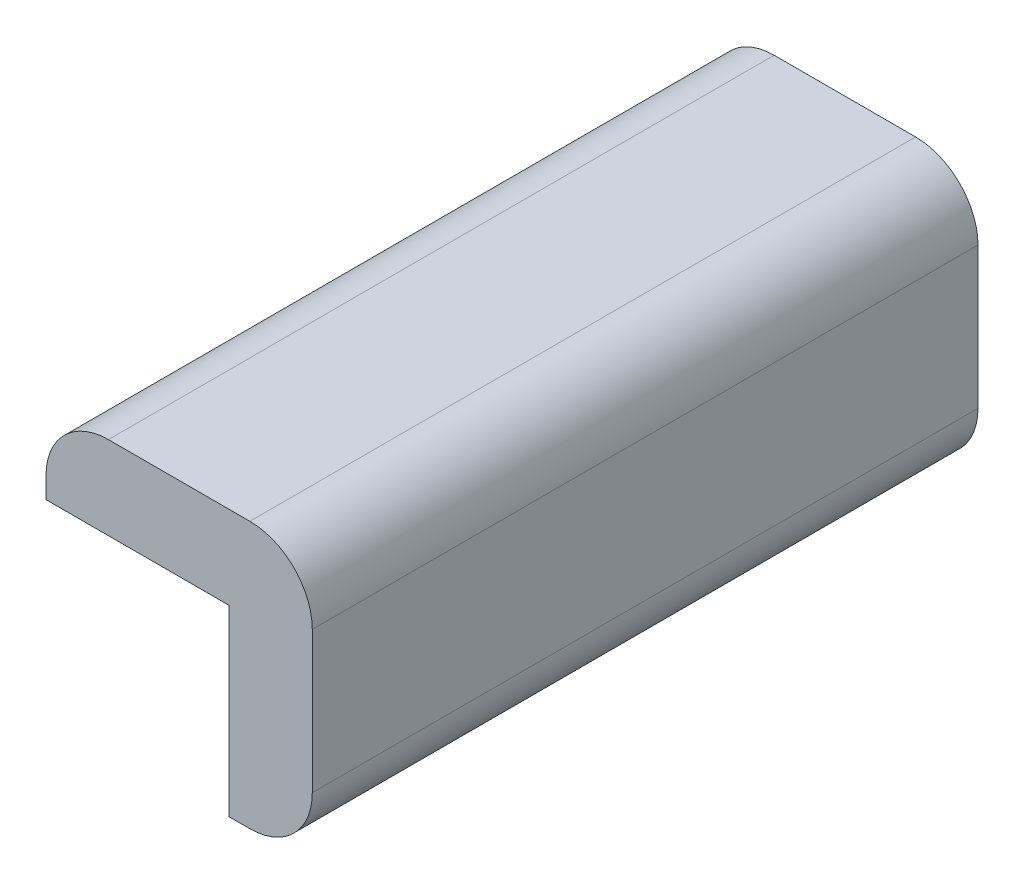
ISO-10303-21;
HEADER;
FILE_DESCRIPTION(('STEP AP214'),'2;1');
FILE_NAME('part.step','',(''),(''),'','','');
FILE_SCHEMA(('AUTOMOTIVE_DESIGN { 1 0 10303 214 1 1 1 1 }'));
ENDSEC;
DATA;
#1=APPLICATION_CONTEXT('core data for automotive mechanical design processes');
#2=APPLICATION_PROTOCOL_DEFINITION('international standard','automotive_design',2000,#1);
#3=PRODUCT_CONTEXT('',#1,'mechanical');
#4=PRODUCT('Part','Part','',(#3));
#5=PRODUCT_RELATED_PRODUCT_CATEGORY('part','',(#4));
#6=PRODUCT_DEFINITION_FORMATION('','',#4);
#7=PRODUCT_DEFINITION_CONTEXT('part definition',#1,'design');
#8=PRODUCT_DEFINITION('design','',#6,#7);
#9=PRODUCT_DEFINITION_SHAPE('','',#8);
#10=(LENGTH_UNIT() NAMED_UNIT(*) SI_UNIT(.MILLI.,.METRE.));
#11=(NAMED_UNIT(*) PLANE_ANGLE_UNIT() SI_UNIT($,.RADIAN.));
#12=(NAMED_UNIT(*) SI_UNIT($,.STERADIAN.) SOLID_ANGLE_UNIT());
#13=UNCERTAINTY_MEASURE_WITH_UNIT(LENGTH_MEASURE(1.E-05),#10,'distance_accuracy_value','');
#14=(GEOMETRIC_REPRESENTATION_CONTEXT(3) GLOBAL_UNCERTAINTY_ASSIGNED_CONTEXT((#13)) GLOBAL_UNIT_ASSIGNED_CONTEXT((#10,
#11,#12)) REPRESENTATION_CONTEXT('',''));
#15=CARTESIAN_POINT('',(0.,0.,0.));
#16=DIRECTION('',(0.,0.,1.));
#17=DIRECTION('',(1.,0.,0.));
#18=AXIS2_PLACEMENT_3D('',#15,#16,#17);
#19=CARTESIAN_POINT('',(-14.5,24.5,0.));
#20=DIRECTION('',(0.,0.,1.));
#21=DIRECTION('',(1.,0.,0.));
#22=AXIS2_PLACEMENT_3D('',#19,#20,#21);
#23=CYLINDRICAL_SURFACE('',#22,7.5);
#24=CARTESIAN_POINT('',(-14.5,24.5,80.));
#25=DIRECTION('',(0.,0.,1.));
#26=DIRECTION('',(1.,0.,0.));
#27=AXIS2_PLACEMENT_3D('',#24,#25,#26);
#28=CIRCLE('',#27,7.5);
#29=CARTESIAN_POINT('',(-14.5,32.,80.));
#30=VERTEX_POINT('',#29);
#31=CARTESIAN_POINT('',(-22.,24.5,80.));
#32=VERTEX_POINT('',#31);
#33=EDGE_CURVE('E136',#30,#32,#28,.T.);
#34=ORIENTED_EDGE('',*,*,#33,.F.);
#35=DIRECTION('',(0.,0.,1.));
#36=VECTOR('',#35,1.);
#37=CARTESIAN_POINT('',(-14.5,32.,0.));
#38=LINE('',#37,#36);
#39=CARTESIAN_POINT('',(-14.5,32.,0.));
#40=VERTEX_POINT('',#39);
#41=EDGE_CURVE('E11',#40,#30,#38,.T.);
#42=ORIENTED_EDGE('',*,*,#41,.F.);
#43=CARTESIAN_POINT('',(-14.5,24.5,0.));
#44=DIRECTION('',(0.,0.,1.));
#45=DIRECTION('',(1.,0.,0.));
#46=AXIS2_PLACEMENT_3D('',#43,#44,#45);
#47=CIRCLE('',#46,7.5);
#48=CARTESIAN_POINT('',(-22.,24.5,0.));
#49=VERTEX_POINT('',#48);
#50=EDGE_CURVE('E159',#40,#49,#47,.T.);
#51=ORIENTED_EDGE('',*,*,#50,.T.);
#52=DIRECTION('',(0.,0.,1.));
#53=VECTOR('',#52,1.);
#54=CARTESIAN_POINT('',(-22.,24.5,0.));
#55=LINE('',#54,#53);
#56=EDGE_CURVE('E36',#49,#32,#55,.T.);
#57=ORIENTED_EDGE('',*,*,#56,.T.);
#58=EDGE_LOOP('',(#34,#42,#51,#57));
#59=FACE_BOUND('',#58,.T.);
#60=ADVANCED_FACE('F33',(#59),#23,.T.);
#61=CARTESIAN_POINT('',(2.5,32.,0.));
#62=DIRECTION('',(0.,1.,0.));
#63=DIRECTION('',(0.,0.,1.));
#64=AXIS2_PLACEMENT_3D('',#61,#62,#63);
#65=PLANE('',#64);
#66=DIRECTION('',(-1.,0.,0.));
#67=VECTOR('',#66,1.);
#68=CARTESIAN_POINT('',(2.5,32.,80.));
#69=LINE('',#68,#67);
#70=CARTESIAN_POINT('',(2.5,32.,80.));
#71=VERTEX_POINT('',#70);
#72=EDGE_CURVE('E157',#71,#30,#69,.T.);
#73=ORIENTED_EDGE('',*,*,#72,.F.);
#74=DIRECTION('',(0.,0.,1.));
#75=VECTOR('',#74,1.);
#76=CARTESIAN_POINT('',(2.5,32.,0.));
#77=LINE('',#76,#75);
#78=CARTESIAN_POINT('',(2.5,32.,0.));
#79=VERTEX_POINT('',#78);
#80=EDGE_CURVE('E42',#79,#71,#77,.T.);
#81=ORIENTED_EDGE('',*,*,#80,.F.);
#82=DIRECTION('',(-1.,0.,0.));
#83=VECTOR('',#82,1.);
#84=CARTESIAN_POINT('',(2.5,32.,0.));
#85=LINE('',#84,#83);
#86=EDGE_CURVE('E126',#79,#40,#85,.T.);
#87=ORIENTED_EDGE('',*,*,#86,.T.);
#88=ORIENTED_EDGE('',*,*,#41,.T.);
#89=EDGE_LOOP('',(#73,#81,#87,#88));
#90=FACE_BOUND('',#89,.T.);
#91=ADVANCED_FACE('F173',(#90),#65,.T.);
#92=CARTESIAN_POINT('',(2.5,24.5,0.));
#93=DIRECTION('',(0.,0.,1.));
#94=DIRECTION('',(1.,0.,0.));
#95=AXIS2_PLACEMENT_3D('',#92,#93,#94);
#96=CYLINDRICAL_SURFACE('',#95,7.5);
#97=CARTESIAN_POINT('',(2.5,24.5,80.));
#98=DIRECTION('',(0.,0.,1.));
#99=DIRECTION('',(1.,0.,0.));
#100=AXIS2_PLACEMENT_3D('',#97,#98,#99);
#101=CIRCLE('',#100,7.5);
#102=CARTESIAN_POINT('',(10.,24.5,80.));
#103=VERTEX_POINT('',#102);
#104=EDGE_CURVE('E113',#103,#71,#101,.T.);
#105=ORIENTED_EDGE('',*,*,#104,.F.);
#106=DIRECTION('',(0.,0.,1.));
#107=VECTOR('',#106,1.);
#108=CARTESIAN_POINT('',(10.,24.5,0.));
#109=LINE('',#108,#107);
#110=CARTESIAN_POINT('',(10.,24.5,0.));
#111=VERTEX_POINT('',#110);
#112=EDGE_CURVE('E108',#111,#103,#109,.T.);
#113=ORIENTED_EDGE('',*,*,#112,.F.);
#114=CARTESIAN_POINT('',(2.5,24.5,0.));
#115=DIRECTION('',(0.,0.,1.));
#116=DIRECTION('',(1.,0.,0.));
#117=AXIS2_PLACEMENT_3D('',#114,#115,#116);
#118=CIRCLE('',#117,7.5);
#119=EDGE_CURVE('E111',#111,#79,#118,.T.);
#120=ORIENTED_EDGE('',*,*,#119,.T.);
#121=ORIENTED_EDGE('',*,*,#80,.T.);
#122=EDGE_LOOP('',(#105,#113,#120,#121));
#123=FACE_BOUND('',#122,.T.);
#124=ADVANCED_FACE('F110',(#123),#96,.T.);
#125=CARTESIAN_POINT('',(10.,7.5,0.));
#126=DIRECTION('',(1.,0.,0.));
#127=DIRECTION('',(0.,0.,-1.));
#128=AXIS2_PLACEMENT_3D('',#125,#126,#127);
#129=PLANE('',#128);
#130=DIRECTION('',(0.,1.,0.));
#131=VECTOR('',#130,1.);
#132=CARTESIAN_POINT('',(10.,7.5,80.));
#133=LINE('',#132,#131);
#134=CARTESIAN_POINT('',(10.,7.5,80.));
#135=VERTEX_POINT('',#134);
#136=EDGE_CURVE('E154',#135,#103,#133,.T.);
#137=ORIENTED_EDGE('',*,*,#136,.F.);
#138=DIRECTION('',(0.,0.,1.));
#139=VECTOR('',#138,1.);
#140=CARTESIAN_POINT('',(10.,7.5,0.));
#141=LINE('',#140,#139);
#142=CARTESIAN_POINT('',(10.,7.5,0.));
#143=VERTEX_POINT('',#142);
#144=EDGE_CURVE('E118',#143,#135,#141,.T.);
#145=ORIENTED_EDGE('',*,*,#144,.F.);
#146=DIRECTION('',(0.,1.,0.));
#147=VECTOR('',#146,1.);
#148=CARTESIAN_POINT('',(10.,7.5,0.));
#149=LINE('',#148,#147);
#150=EDGE_CURVE('E124',#143,#111,#149,.T.);
#151=ORIENTED_EDGE('',*,*,#150,.T.);
#152=ORIENTED_EDGE('',*,*,#112,.T.);
#153=EDGE_LOOP('',(#137,#145,#151,#152));
#154=FACE_BOUND('',#153,.T.);
#155=ADVANCED_FACE('F128',(#154),#129,.T.);
#156=CARTESIAN_POINT('',(2.5,7.5,0.));
#157=DIRECTION('',(0.,0.,1.));
#158=DIRECTION('',(1.,0.,0.));
#159=AXIS2_PLACEMENT_3D('',#156,#157,#158);
#160=CYLINDRICAL_SURFACE('',#159,7.5);
#161=CARTESIAN_POINT('',(2.5,7.5,80.));
#162=DIRECTION('',(0.,0.,1.));
#163=DIRECTION('',(1.,0.,0.));
#164=AXIS2_PLACEMENT_3D('',#161,#162,#163);
#165=CIRCLE('',#164,7.5);
#166=CARTESIAN_POINT('',(2.5,0.,80.));
#167=VERTEX_POINT('',#166);
#168=EDGE_CURVE('E151',#167,#135,#165,.T.);
#169=ORIENTED_EDGE('',*,*,#168,.F.);
#170=DIRECTION('',(0.,0.,1.));
#171=VECTOR('',#170,1.);
#172=CARTESIAN_POINT('',(2.5,0.,0.));
#173=LINE('',#172,#171);
#174=CARTESIAN_POINT('',(2.5,0.,0.));
#175=VERTEX_POINT('',#174);
#176=EDGE_CURVE('E163',#175,#167,#173,.T.);
#177=ORIENTED_EDGE('',*,*,#176,.F.);
#178=CARTESIAN_POINT('',(2.5,7.5,0.));
#179=DIRECTION('',(0.,0.,1.));
#180=DIRECTION('',(1.,0.,0.));
#181=AXIS2_PLACEMENT_3D('',#178,#179,#180);
#182=CIRCLE('',#181,7.5);
#183=EDGE_CURVE('E129',#175,#143,#182,.T.);
#184=ORIENTED_EDGE('',*,*,#183,.T.);
#185=ORIENTED_EDGE('',*,*,#144,.T.);
#186=EDGE_LOOP('',(#169,#177,#184,#185));
#187=FACE_BOUND('',#186,.T.);
#188=ADVANCED_FACE('F186',(#187),#160,.T.);
#189=CARTESIAN_POINT('',(0.,0.,0.));
#190=DIRECTION('',(0.,-1.,0.));
#191=DIRECTION('',(0.,0.,-1.));
#192=AXIS2_PLACEMENT_3D('',#189,#190,#191);
#193=PLANE('',#192);
#194=DIRECTION('',(1.,0.,0.));
#195=VECTOR('',#194,1.);
#196=CARTESIAN_POINT('',(0.,0.,80.));
#197=LINE('',#196,#195);
#198=CARTESIAN_POINT('',(0.,0.,80.));
#199=VERTEX_POINT('',#198);
#200=EDGE_CURVE('E148',#199,#167,#197,.T.);
#201=ORIENTED_EDGE('',*,*,#200,.F.);
#202=DIRECTION('',(0.,0.,1.));
#203=VECTOR('',#202,1.);
#204=CARTESIAN_POINT('',(0.,0.,0.));
#205=LINE('',#204,#203);
#206=CARTESIAN_POINT('',(0.,0.,0.));
#207=VERTEX_POINT('',#206);
#208=EDGE_CURVE('E165',#207,#199,#205,.T.);
#209=ORIENTED_EDGE('',*,*,#208,.F.);
#210=DIRECTION('',(1.,0.,0.));
#211=VECTOR('',#210,1.);
#212=CARTESIAN_POINT('',(0.,0.,0.));
#213=LINE('',#212,#211);
#214=EDGE_CURVE('E131',#207,#175,#213,.T.);
#215=ORIENTED_EDGE('',*,*,#214,.T.);
#216=ORIENTED_EDGE('',*,*,#176,.T.);
#217=EDGE_LOOP('',(#201,#209,#215,#216));
#218=FACE_BOUND('',#217,.T.);
#219=ADVANCED_FACE('F189',(#218),#193,.T.);
#220=CARTESIAN_POINT('',(0.,22.,0.));
#221=DIRECTION('',(-1.,0.,0.));
#222=DIRECTION('',(0.,-1.,0.));
#223=AXIS2_PLACEMENT_3D('',#220,#221,#222);
#224=PLANE('',#223);
#225=DIRECTION('',(0.,-1.,0.));
#226=VECTOR('',#225,1.);
#227=CARTESIAN_POINT('',(0.,22.,80.));
#228=LINE('',#227,#226);
#229=CARTESIAN_POINT('',(0.,22.,80.));
#230=VERTEX_POINT('',#229);
#231=EDGE_CURVE('E145',#230,#199,#228,.T.);
#232=ORIENTED_EDGE('',*,*,#231,.F.);
#233=DIRECTION('',(0.,0.,1.));
#234=VECTOR('',#233,1.);
#235=CARTESIAN_POINT('',(0.,22.,0.));
#236=LINE('',#235,#234);
#237=CARTESIAN_POINT('',(0.,22.,0.));
#238=VERTEX_POINT('',#237);
#239=EDGE_CURVE('E167',#238,#230,#236,.T.);
#240=ORIENTED_EDGE('',*,*,#239,.F.);
#241=DIRECTION('',(0.,-1.,0.));
#242=VECTOR('',#241,1.);
#243=CARTESIAN_POINT('',(0.,22.,0.));
#244=LINE('',#243,#242);
#245=EDGE_CURVE('E274',#238,#207,#244,.T.);
#246=ORIENTED_EDGE('',*,*,#245,.T.);
#247=ORIENTED_EDGE('',*,*,#208,.T.);
#248=EDGE_LOOP('',(#232,#240,#246,#247));
#249=FACE_BOUND('',#248,.T.);
#250=ADVANCED_FACE('F193',(#249),#224,.T.);
#251=CARTESIAN_POINT('',(-22.,22.,0.));
#252=DIRECTION('',(0.,-1.,0.));
#253=DIRECTION('',(0.,0.,-1.));
#254=AXIS2_PLACEMENT_3D('',#251,#252,#253);
#255=PLANE('',#254);
#256=DIRECTION('',(1.,0.,0.));
#257=VECTOR('',#256,1.);
#258=CARTESIAN_POINT('',(-22.,22.,80.));
#259=LINE('',#258,#257);
#260=CARTESIAN_POINT('',(-22.,22.,80.));
#261=VERTEX_POINT('',#260);
#262=EDGE_CURVE('E142',#261,#230,#259,.T.);
#263=ORIENTED_EDGE('',*,*,#262,.F.);
#264=DIRECTION('',(0.,0.,1.));
#265=VECTOR('',#264,1.);
#266=CARTESIAN_POINT('',(-22.,22.,0.));
#267=LINE('',#266,#265);
#268=CARTESIAN_POINT('',(-22.,22.,0.));
#269=VERTEX_POINT('',#268);
#270=EDGE_CURVE('E168',#269,#261,#267,.T.);
#271=ORIENTED_EDGE('',*,*,#270,.F.);
#272=DIRECTION('',(1.,0.,0.));
#273=VECTOR('',#272,1.);
#274=CARTESIAN_POINT('',(-22.,22.,0.));
#275=LINE('',#274,#273);
#276=EDGE_CURVE('E278',#269,#238,#275,.T.);
#277=ORIENTED_EDGE('',*,*,#276,.T.);
#278=ORIENTED_EDGE('',*,*,#239,.T.);
#279=EDGE_LOOP('',(#263,#271,#277,#278));
#280=FACE_BOUND('',#279,.T.);
#281=ADVANCED_FACE('F197',(#280),#255,.T.);
#282=CARTESIAN_POINT('',(-22.,24.5,0.));
#283=DIRECTION('',(-1.,0.,0.));
#284=DIRECTION('',(0.,0.,1.));
#285=AXIS2_PLACEMENT_3D('',#282,#283,#284);
#286=PLANE('',#285);
#287=DIRECTION('',(0.,-1.,0.));
#288=VECTOR('',#287,1.);
#289=CARTESIAN_POINT('',(-22.,24.5,80.));
#290=LINE('',#289,#288);
#291=EDGE_CURVE('E139',#32,#261,#290,.T.);
#292=ORIENTED_EDGE('',*,*,#291,.F.);
#293=ORIENTED_EDGE('',*,*,#56,.F.);
#294=DIRECTION('',(0.,-1.,0.));
#295=VECTOR('',#294,1.);
#296=CARTESIAN_POINT('',(-22.,24.5,0.));
#297=LINE('',#296,#295);
#298=EDGE_CURVE('E282',#49,#269,#297,.T.);
#299=ORIENTED_EDGE('',*,*,#298,.T.);
#300=ORIENTED_EDGE('',*,*,#270,.T.);
#301=EDGE_LOOP('',(#292,#293,#299,#300));
#302=FACE_BOUND('',#301,.T.);
#303=ADVANCED_FACE('F170',(#302),#286,.T.);
#304=CARTESIAN_POINT('',(-14.5,24.5,0.));
#305=DIRECTION('',(0.,0.,1.));
#306=DIRECTION('',(1.,0.,0.));
#307=AXIS2_PLACEMENT_3D('',#304,#305,#306);
#308=PLANE('',#307);
#309=ORIENTED_EDGE('',*,*,#50,.F.);
#310=ORIENTED_EDGE('',*,*,#86,.F.);
#311=ORIENTED_EDGE('',*,*,#119,.F.);
#312=ORIENTED_EDGE('',*,*,#150,.F.);
#313=ORIENTED_EDGE('',*,*,#183,.F.);
#314=ORIENTED_EDGE('',*,*,#214,.F.);
#315=ORIENTED_EDGE('',*,*,#245,.F.);
#316=ORIENTED_EDGE('',*,*,#276,.F.);
#317=ORIENTED_EDGE('',*,*,#298,.F.);
#318=EDGE_LOOP('',(#309,#310,#311,#312,#313,#314,#315,#316,#317));
#319=FACE_BOUND('',#318,.T.);
#320=ADVANCED_FACE('F122',(#319),#308,.F.);
#321=CARTESIAN_POINT('',(-14.5,24.5,80.));
#322=DIRECTION('',(0.,0.,1.));
#323=DIRECTION('',(1.,0.,0.));
#324=AXIS2_PLACEMENT_3D('',#321,#322,#323);
#325=PLANE('',#324);
#326=ORIENTED_EDGE('',*,*,#33,.T.);
#327=ORIENTED_EDGE('',*,*,#291,.T.);
#328=ORIENTED_EDGE('',*,*,#262,.T.);
#329=ORIENTED_EDGE('',*,*,#231,.T.);
#330=ORIENTED_EDGE('',*,*,#200,.T.);
#331=ORIENTED_EDGE('',*,*,#168,.T.);
#332=ORIENTED_EDGE('',*,*,#136,.T.);
#333=ORIENTED_EDGE('',*,*,#104,.T.);
#334=ORIENTED_EDGE('',*,*,#72,.T.);
#335=EDGE_LOOP('',(#326,#327,#328,#329,#330,#331,#332,#333,#334));
#336=FACE_BOUND('',#335,.T.);
#337=ADVANCED_FACE('F172',(#336),#325,.T.);
#338=CLOSED_SHELL('',(#60,#91,#124,#155,#188,#219,#250,#281,#303,#320,#337));
#339=MANIFOLD_SOLID_BREP('B2',#338);
#340=ADVANCED_BREP_SHAPE_REPRESENTATION('',(#18,#339),#14);
#341=SHAPE_DEFINITION_REPRESENTATION(#9,#340);
ENDSEC;
END-ISO-10303-21;
